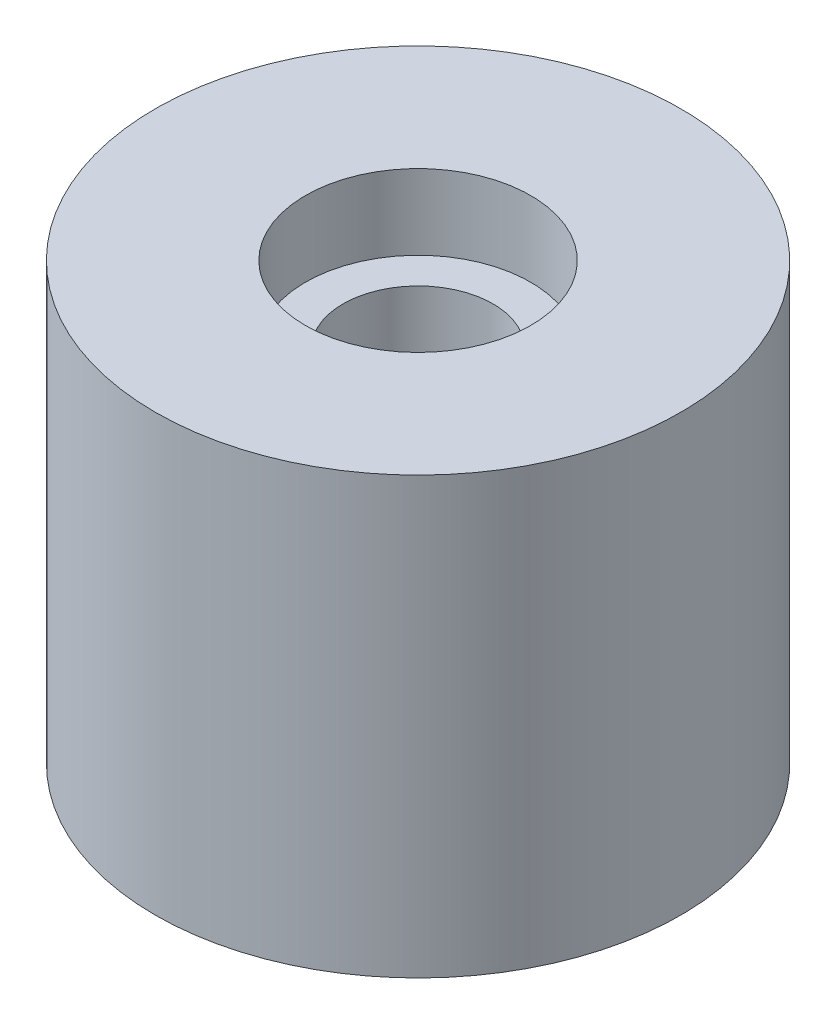
ISO-10303-21;
HEADER;
FILE_DESCRIPTION(('STEP AP214'),'2;1');
FILE_NAME('part.step','',(''),(''),'','','');
FILE_SCHEMA(('AUTOMOTIVE_DESIGN { 1 0 10303 214 1 1 1 1 }'));
ENDSEC;
DATA;
#1=APPLICATION_CONTEXT('core data for automotive mechanical design processes');
#2=APPLICATION_PROTOCOL_DEFINITION('international standard','automotive_design',2000,#1);
#3=PRODUCT_CONTEXT('',#1,'mechanical');
#4=PRODUCT('Part','Part','',(#3));
#5=PRODUCT_RELATED_PRODUCT_CATEGORY('part','',(#4));
#6=PRODUCT_DEFINITION_FORMATION('','',#4);
#7=PRODUCT_DEFINITION_CONTEXT('part definition',#1,'design');
#8=PRODUCT_DEFINITION('design','',#6,#7);
#9=PRODUCT_DEFINITION_SHAPE('','',#8);
#10=(LENGTH_UNIT() NAMED_UNIT(*) SI_UNIT(.MILLI.,.METRE.));
#11=(NAMED_UNIT(*) PLANE_ANGLE_UNIT() SI_UNIT($,.RADIAN.));
#12=(NAMED_UNIT(*) SI_UNIT($,.STERADIAN.) SOLID_ANGLE_UNIT());
#13=UNCERTAINTY_MEASURE_WITH_UNIT(LENGTH_MEASURE(1.E-05),#10,'distance_accuracy_value','');
#14=(GEOMETRIC_REPRESENTATION_CONTEXT(3) GLOBAL_UNCERTAINTY_ASSIGNED_CONTEXT((#13)) GLOBAL_UNIT_ASSIGNED_CONTEXT((#10,
#11,#12)) REPRESENTATION_CONTEXT('',''));
#15=CARTESIAN_POINT('',(0.,0.,0.));
#16=DIRECTION('',(0.,0.,1.));
#17=DIRECTION('',(1.,0.,0.));
#18=AXIS2_PLACEMENT_3D('',#15,#16,#17);
#19=CARTESIAN_POINT('',(17.5,15.0474860335195,0.));
#20=DIRECTION('',(0.,-1.,0.));
#21=DIRECTION('',(0.,0.,-1.));
#22=AXIS2_PLACEMENT_3D('',#19,#20,#21);
#23=PLANE('',#22);
#24=CARTESIAN_POINT('',(0.,15.0474860335195,0.));
#25=DIRECTION('',(0.,1.,0.));
#26=DIRECTION('',(0.,0.,1.));
#27=AXIS2_PLACEMENT_3D('',#24,#25,#26);
#28=CIRCLE('',#27,7.5);
#29=CARTESIAN_POINT('',(0.,15.0474860335195,7.5));
#30=VERTEX_POINT('',#29);
#31=EDGE_CURVE('E10',#30,#30,#28,.T.);
#32=ORIENTED_EDGE('',*,*,#31,.F.);
#33=EDGE_LOOP('',(#32));
#34=FACE_BOUND('',#33,.T.);
#35=CARTESIAN_POINT('',(0.,15.0474860335196,0.));
#36=DIRECTION('',(0.,1.,0.));
#37=DIRECTION('',(0.,0.,1.));
#38=AXIS2_PLACEMENT_3D('',#35,#36,#37);
#39=CIRCLE('',#38,17.5);
#40=CARTESIAN_POINT('',(0.,15.0474860335196,17.5));
#41=VERTEX_POINT('',#40);
#42=EDGE_CURVE('E72',#41,#41,#39,.T.);
#43=ORIENTED_EDGE('',*,*,#42,.T.);
#44=EDGE_LOOP('',(#43));
#45=FACE_BOUND('',#44,.T.);
#46=ADVANCED_FACE('F37',(#34,#45),#23,.F.);
#47=CARTESIAN_POINT('',(0.,16.0474860335196,0.));
#48=DIRECTION('',(0.,1.,0.));
#49=DIRECTION('',(0.,0.,1.));
#50=AXIS2_PLACEMENT_3D('',#47,#48,#49);
#51=CYLINDRICAL_SURFACE('',#50,7.5);
#52=CARTESIAN_POINT('',(0.,10.0474860335195,0.));
#53=DIRECTION('',(0.,1.,0.));
#54=DIRECTION('',(0.,0.,1.));
#55=AXIS2_PLACEMENT_3D('',#52,#53,#54);
#56=CIRCLE('',#55,7.5);
#57=CARTESIAN_POINT('',(0.,10.0474860335195,7.5));
#58=VERTEX_POINT('',#57);
#59=EDGE_CURVE('E44',#58,#58,#56,.T.);
#60=ORIENTED_EDGE('',*,*,#59,.F.);
#61=EDGE_LOOP('',(#60));
#62=FACE_BOUND('',#61,.T.);
#63=ORIENTED_EDGE('',*,*,#31,.T.);
#64=EDGE_LOOP('',(#63));
#65=FACE_BOUND('',#64,.T.);
#66=ADVANCED_FACE('F110',(#62,#65),#51,.F.);
#67=CARTESIAN_POINT('',(7.5,10.0474860335195,0.));
#68=DIRECTION('',(0.,-1.,0.));
#69=DIRECTION('',(0.,0.,-1.));
#70=AXIS2_PLACEMENT_3D('',#67,#68,#69);
#71=PLANE('',#70);
#72=CARTESIAN_POINT('',(0.,10.0474860335195,0.));
#73=DIRECTION('',(0.,1.,0.));
#74=DIRECTION('',(0.,0.,1.));
#75=AXIS2_PLACEMENT_3D('',#72,#73,#74);
#76=CIRCLE('',#75,5.);
#77=CARTESIAN_POINT('',(0.,10.0474860335195,5.));
#78=VERTEX_POINT('',#77);
#79=EDGE_CURVE('E49',#78,#78,#76,.T.);
#80=ORIENTED_EDGE('',*,*,#79,.F.);
#81=EDGE_LOOP('',(#80));
#82=FACE_BOUND('',#81,.T.);
#83=ORIENTED_EDGE('',*,*,#59,.T.);
#84=EDGE_LOOP('',(#83));
#85=FACE_BOUND('',#84,.T.);
#86=ADVANCED_FACE('F105',(#82,#85),#71,.F.);
#87=CARTESIAN_POINT('',(0.,16.0474860335196,0.));
#88=DIRECTION('',(0.,1.,0.));
#89=DIRECTION('',(0.,0.,1.));
#90=AXIS2_PLACEMENT_3D('',#87,#88,#89);
#91=CYLINDRICAL_SURFACE('',#90,5.);
#92=CARTESIAN_POINT('',(0.,-8.95251396648045,0.));
#93=DIRECTION('',(0.,1.,0.));
#94=DIRECTION('',(0.,0.,1.));
#95=AXIS2_PLACEMENT_3D('',#92,#93,#94);
#96=CIRCLE('',#95,5.);
#97=CARTESIAN_POINT('',(0.,-8.95251396648045,5.));
#98=VERTEX_POINT('',#97);
#99=EDGE_CURVE('E54',#98,#98,#96,.T.);
#100=ORIENTED_EDGE('',*,*,#99,.F.);
#101=EDGE_LOOP('',(#100));
#102=FACE_BOUND('',#101,.T.);
#103=ORIENTED_EDGE('',*,*,#79,.T.);
#104=EDGE_LOOP('',(#103));
#105=FACE_BOUND('',#104,.T.);
#106=ADVANCED_FACE('F99',(#102,#105),#91,.F.);
#107=CARTESIAN_POINT('',(5.,-8.95251396648045,0.));
#108=DIRECTION('',(0.,1.,0.));
#109=DIRECTION('',(0.,0.,1.));
#110=AXIS2_PLACEMENT_3D('',#107,#108,#109);
#111=PLANE('',#110);
#112=CARTESIAN_POINT('',(0.,-8.95251396648045,0.));
#113=DIRECTION('',(0.,1.,0.));
#114=DIRECTION('',(0.,0.,1.));
#115=AXIS2_PLACEMENT_3D('',#112,#113,#114);
#116=CIRCLE('',#115,7.5);
#117=CARTESIAN_POINT('',(0.,-8.95251396648045,7.5));
#118=VERTEX_POINT('',#117);
#119=EDGE_CURVE('E60',#118,#118,#116,.T.);
#120=ORIENTED_EDGE('',*,*,#119,.F.);
#121=EDGE_LOOP('',(#120));
#122=FACE_BOUND('',#121,.T.);
#123=ORIENTED_EDGE('',*,*,#99,.T.);
#124=EDGE_LOOP('',(#123));
#125=FACE_BOUND('',#124,.T.);
#126=ADVANCED_FACE('F93',(#122,#125),#111,.F.);
#127=CARTESIAN_POINT('',(0.,16.0474860335196,0.));
#128=DIRECTION('',(0.,1.,0.));
#129=DIRECTION('',(0.,0.,1.));
#130=AXIS2_PLACEMENT_3D('',#127,#128,#129);
#131=CYLINDRICAL_SURFACE('',#130,7.5);
#132=CARTESIAN_POINT('',(0.,-13.9525139664804,0.));
#133=DIRECTION('',(0.,1.,0.));
#134=DIRECTION('',(0.,0.,1.));
#135=AXIS2_PLACEMENT_3D('',#132,#133,#134);
#136=CIRCLE('',#135,7.5);
#137=CARTESIAN_POINT('',(0.,-13.9525139664804,7.5));
#138=VERTEX_POINT('',#137);
#139=EDGE_CURVE('E64',#138,#138,#136,.T.);
#140=ORIENTED_EDGE('',*,*,#139,.F.);
#141=EDGE_LOOP('',(#140));
#142=FACE_BOUND('',#141,.T.);
#143=ORIENTED_EDGE('',*,*,#119,.T.);
#144=EDGE_LOOP('',(#143));
#145=FACE_BOUND('',#144,.T.);
#146=ADVANCED_FACE('F87',(#142,#145),#131,.F.);
#147=CARTESIAN_POINT('',(7.5,-13.9525139664804,0.));
#148=DIRECTION('',(0.,1.,0.));
#149=DIRECTION('',(0.,0.,1.));
#150=AXIS2_PLACEMENT_3D('',#147,#148,#149);
#151=PLANE('',#150);
#152=CARTESIAN_POINT('',(0.,-13.9525139664804,0.));
#153=DIRECTION('',(0.,1.,0.));
#154=DIRECTION('',(0.,0.,1.));
#155=AXIS2_PLACEMENT_3D('',#152,#153,#154);
#156=CIRCLE('',#155,17.5);
#157=CARTESIAN_POINT('',(0.,-13.9525139664804,17.5));
#158=VERTEX_POINT('',#157);
#159=EDGE_CURVE('E68',#158,#158,#156,.T.);
#160=ORIENTED_EDGE('',*,*,#159,.F.);
#161=EDGE_LOOP('',(#160));
#162=FACE_BOUND('',#161,.T.);
#163=ORIENTED_EDGE('',*,*,#139,.T.);
#164=EDGE_LOOP('',(#163));
#165=FACE_BOUND('',#164,.T.);
#166=ADVANCED_FACE('F81',(#162,#165),#151,.F.);
#167=CARTESIAN_POINT('',(0.,16.0474860335196,0.));
#168=DIRECTION('',(0.,1.,0.));
#169=DIRECTION('',(0.,0.,1.));
#170=AXIS2_PLACEMENT_3D('',#167,#168,#169);
#171=CYLINDRICAL_SURFACE('',#170,17.5);
#172=ORIENTED_EDGE('',*,*,#42,.F.);
#173=EDGE_LOOP('',(#172));
#174=FACE_BOUND('',#173,.T.);
#175=ORIENTED_EDGE('',*,*,#159,.T.);
#176=EDGE_LOOP('',(#175));
#177=FACE_BOUND('',#176,.T.);
#178=ADVANCED_FACE('F78',(#174,#177),#171,.T.);
#179=CLOSED_SHELL('',(#46,#66,#86,#106,#126,#146,#166,#178));
#180=MANIFOLD_SOLID_BREP('B2',#179);
#181=ADVANCED_BREP_SHAPE_REPRESENTATION('',(#18,#180),#14);
#182=SHAPE_DEFINITION_REPRESENTATION(#9,#181);
ENDSEC;
END-ISO-10303-21;
